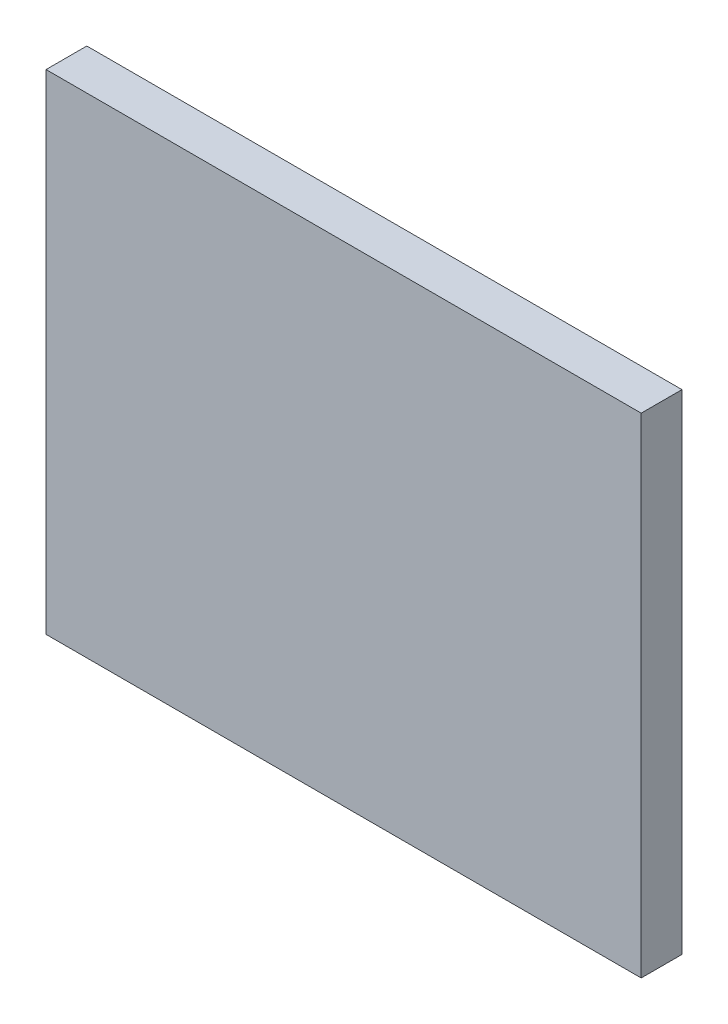
ISO-10303-21;
HEADER;
FILE_DESCRIPTION(('STEP AP214'),'2;1');
FILE_NAME('part.step','',(''),(''),'','','');
FILE_SCHEMA(('AUTOMOTIVE_DESIGN { 1 0 10303 214 1 1 1 1 }'));
ENDSEC;
DATA;
#1=APPLICATION_CONTEXT('core data for automotive mechanical design processes');
#2=APPLICATION_PROTOCOL_DEFINITION('international standard','automotive_design',2000,#1);
#3=PRODUCT_CONTEXT('',#1,'mechanical');
#4=PRODUCT('Part','Part','',(#3));
#5=PRODUCT_RELATED_PRODUCT_CATEGORY('part','',(#4));
#6=PRODUCT_DEFINITION_FORMATION('','',#4);
#7=PRODUCT_DEFINITION_CONTEXT('part definition',#1,'design');
#8=PRODUCT_DEFINITION('design','',#6,#7);
#9=PRODUCT_DEFINITION_SHAPE('','',#8);
#10=(LENGTH_UNIT() NAMED_UNIT(*) SI_UNIT(.MILLI.,.METRE.));
#11=(NAMED_UNIT(*) PLANE_ANGLE_UNIT() SI_UNIT($,.RADIAN.));
#12=(NAMED_UNIT(*) SI_UNIT($,.STERADIAN.) SOLID_ANGLE_UNIT());
#13=UNCERTAINTY_MEASURE_WITH_UNIT(LENGTH_MEASURE(1.E-05),#10,'distance_accuracy_value','');
#14=(GEOMETRIC_REPRESENTATION_CONTEXT(3) GLOBAL_UNCERTAINTY_ASSIGNED_CONTEXT((#13)) GLOBAL_UNIT_ASSIGNED_CONTEXT((#10,
#11,#12)) REPRESENTATION_CONTEXT('',''));
#15=CARTESIAN_POINT('',(0.,0.,0.));
#16=DIRECTION('',(0.,0.,1.));
#17=DIRECTION('',(1.,0.,0.));
#18=AXIS2_PLACEMENT_3D('',#15,#16,#17);
#19=CARTESIAN_POINT('',(0.,0.,25.));
#20=DIRECTION('',(-1.,0.,0.));
#21=DIRECTION('',(0.,-1.,0.));
#22=AXIS2_PLACEMENT_3D('',#19,#20,#21);
#23=PLANE('',#22);
#24=DIRECTION('',(0.,1.,0.));
#25=VECTOR('',#24,1.);
#26=CARTESIAN_POINT('',(0.,0.,0.));
#27=LINE('',#26,#25);
#28=CARTESIAN_POINT('',(0.,0.,0.));
#29=VERTEX_POINT('',#28);
#30=CARTESIAN_POINT('',(0.,300.,0.));
#31=VERTEX_POINT('',#30);
#32=EDGE_CURVE('E107',#29,#31,#27,.T.);
#33=ORIENTED_EDGE('',*,*,#32,.T.);
#34=DIRECTION('',(0.,0.,-1.));
#35=VECTOR('',#34,1.);
#36=CARTESIAN_POINT('',(0.,300.,25.));
#37=LINE('',#36,#35);
#38=CARTESIAN_POINT('',(0.,300.,25.));
#39=VERTEX_POINT('',#38);
#40=EDGE_CURVE('E11',#39,#31,#37,.T.);
#41=ORIENTED_EDGE('',*,*,#40,.F.);
#42=DIRECTION('',(0.,1.,0.));
#43=VECTOR('',#42,1.);
#44=CARTESIAN_POINT('',(0.,0.,25.));
#45=LINE('',#44,#43);
#46=CARTESIAN_POINT('',(0.,0.,25.));
#47=VERTEX_POINT('',#46);
#48=EDGE_CURVE('E91',#47,#39,#45,.T.);
#49=ORIENTED_EDGE('',*,*,#48,.F.);
#50=DIRECTION('',(0.,0.,-1.));
#51=VECTOR('',#50,1.);
#52=CARTESIAN_POINT('',(0.,0.,25.));
#53=LINE('',#52,#51);
#54=EDGE_CURVE('E103',#47,#29,#53,.T.);
#55=ORIENTED_EDGE('',*,*,#54,.T.);
#56=EDGE_LOOP('',(#33,#41,#49,#55));
#57=FACE_BOUND('',#56,.T.);
#58=ADVANCED_FACE('F39',(#57),#23,.F.);
#59=CARTESIAN_POINT('',(0.,300.,25.));
#60=DIRECTION('',(0.,-1.,0.));
#61=DIRECTION('',(1.,0.,0.));
#62=AXIS2_PLACEMENT_3D('',#59,#60,#61);
#63=PLANE('',#62);
#64=DIRECTION('',(-1.,0.,0.));
#65=VECTOR('',#64,1.);
#66=CARTESIAN_POINT('',(0.,300.,0.));
#67=LINE('',#66,#65);
#68=CARTESIAN_POINT('',(-365.,300.,0.));
#69=VERTEX_POINT('',#68);
#70=EDGE_CURVE('E96',#31,#69,#67,.T.);
#71=ORIENTED_EDGE('',*,*,#70,.T.);
#72=DIRECTION('',(0.,0.,-1.));
#73=VECTOR('',#72,1.);
#74=CARTESIAN_POINT('',(-365.,300.,25.));
#75=LINE('',#74,#73);
#76=CARTESIAN_POINT('',(-365.,300.,25.));
#77=VERTEX_POINT('',#76);
#78=EDGE_CURVE('E48',#77,#69,#75,.T.);
#79=ORIENTED_EDGE('',*,*,#78,.F.);
#80=DIRECTION('',(-1.,0.,0.));
#81=VECTOR('',#80,1.);
#82=CARTESIAN_POINT('',(0.,300.,25.));
#83=LINE('',#82,#81);
#84=EDGE_CURVE('E86',#39,#77,#83,.T.);
#85=ORIENTED_EDGE('',*,*,#84,.F.);
#86=ORIENTED_EDGE('',*,*,#40,.T.);
#87=EDGE_LOOP('',(#71,#79,#85,#86));
#88=FACE_BOUND('',#87,.T.);
#89=ADVANCED_FACE('F95',(#88),#63,.F.);
#90=CARTESIAN_POINT('',(-365.,0.,25.));
#91=DIRECTION('',(1.,0.,0.));
#92=DIRECTION('',(0.,0.,-1.));
#93=AXIS2_PLACEMENT_3D('',#90,#91,#92);
#94=PLANE('',#93);
#95=DIRECTION('',(0.,-1.,0.));
#96=VECTOR('',#95,1.);
#97=CARTESIAN_POINT('',(-365.,0.,0.));
#98=LINE('',#97,#96);
#99=CARTESIAN_POINT('',(-365.,0.,0.));
#100=VERTEX_POINT('',#99);
#101=EDGE_CURVE('E73',#69,#100,#98,.T.);
#102=ORIENTED_EDGE('',*,*,#101,.T.);
#103=DIRECTION('',(0.,0.,-1.));
#104=VECTOR('',#103,1.);
#105=CARTESIAN_POINT('',(-365.,0.,25.));
#106=LINE('',#105,#104);
#107=CARTESIAN_POINT('',(-365.,0.,25.));
#108=VERTEX_POINT('',#107);
#109=EDGE_CURVE('E98',#108,#100,#106,.T.);
#110=ORIENTED_EDGE('',*,*,#109,.F.);
#111=DIRECTION('',(0.,-1.,0.));
#112=VECTOR('',#111,1.);
#113=CARTESIAN_POINT('',(-365.,0.,25.));
#114=LINE('',#113,#112);
#115=EDGE_CURVE('E89',#77,#108,#114,.T.);
#116=ORIENTED_EDGE('',*,*,#115,.F.);
#117=ORIENTED_EDGE('',*,*,#78,.T.);
#118=EDGE_LOOP('',(#102,#110,#116,#117));
#119=FACE_BOUND('',#118,.T.);
#120=ADVANCED_FACE('F99',(#119),#94,.F.);
#121=CARTESIAN_POINT('',(0.,0.,25.));
#122=DIRECTION('',(0.,1.,0.));
#123=DIRECTION('',(0.,0.,1.));
#124=AXIS2_PLACEMENT_3D('',#121,#122,#123);
#125=PLANE('',#124);
#126=DIRECTION('',(1.,0.,0.));
#127=VECTOR('',#126,1.);
#128=CARTESIAN_POINT('',(0.,0.,0.));
#129=LINE('',#128,#127);
#130=EDGE_CURVE('E79',#100,#29,#129,.T.);
#131=ORIENTED_EDGE('',*,*,#130,.T.);
#132=ORIENTED_EDGE('',*,*,#54,.F.);
#133=DIRECTION('',(1.,0.,0.));
#134=VECTOR('',#133,1.);
#135=CARTESIAN_POINT('',(0.,0.,25.));
#136=LINE('',#135,#134);
#137=EDGE_CURVE('E56',#108,#47,#136,.T.);
#138=ORIENTED_EDGE('',*,*,#137,.F.);
#139=ORIENTED_EDGE('',*,*,#109,.T.);
#140=EDGE_LOOP('',(#131,#132,#138,#139));
#141=FACE_BOUND('',#140,.T.);
#142=ADVANCED_FACE('F120',(#141),#125,.F.);
#143=CARTESIAN_POINT('',(0.,0.,25.));
#144=DIRECTION('',(0.,0.,1.));
#145=DIRECTION('',(1.,0.,0.));
#146=AXIS2_PLACEMENT_3D('',#143,#144,#145);
#147=PLANE('',#146);
#148=ORIENTED_EDGE('',*,*,#48,.T.);
#149=ORIENTED_EDGE('',*,*,#84,.T.);
#150=ORIENTED_EDGE('',*,*,#115,.T.);
#151=ORIENTED_EDGE('',*,*,#137,.T.);
#152=EDGE_LOOP('',(#148,#149,#150,#151));
#153=FACE_BOUND('',#152,.T.);
#154=ADVANCED_FACE('F87',(#153),#147,.T.);
#155=CARTESIAN_POINT('',(0.,0.,0.));
#156=DIRECTION('',(0.,0.,1.));
#157=DIRECTION('',(1.,0.,0.));
#158=AXIS2_PLACEMENT_3D('',#155,#156,#157);
#159=PLANE('',#158);
#160=ORIENTED_EDGE('',*,*,#32,.F.);
#161=ORIENTED_EDGE('',*,*,#130,.F.);
#162=ORIENTED_EDGE('',*,*,#101,.F.);
#163=ORIENTED_EDGE('',*,*,#70,.F.);
#164=EDGE_LOOP('',(#160,#161,#162,#163));
#165=FACE_BOUND('',#164,.T.);
#166=ADVANCED_FACE('F123',(#165),#159,.F.);
#167=CLOSED_SHELL('',(#58,#89,#120,#142,#154,#166));
#168=MANIFOLD_SOLID_BREP('B2',#167);
#169=ADVANCED_BREP_SHAPE_REPRESENTATION('',(#18,#168),#14);
#170=SHAPE_DEFINITION_REPRESENTATION(#9,#169);
ENDSEC;
END-ISO-10303-21;
